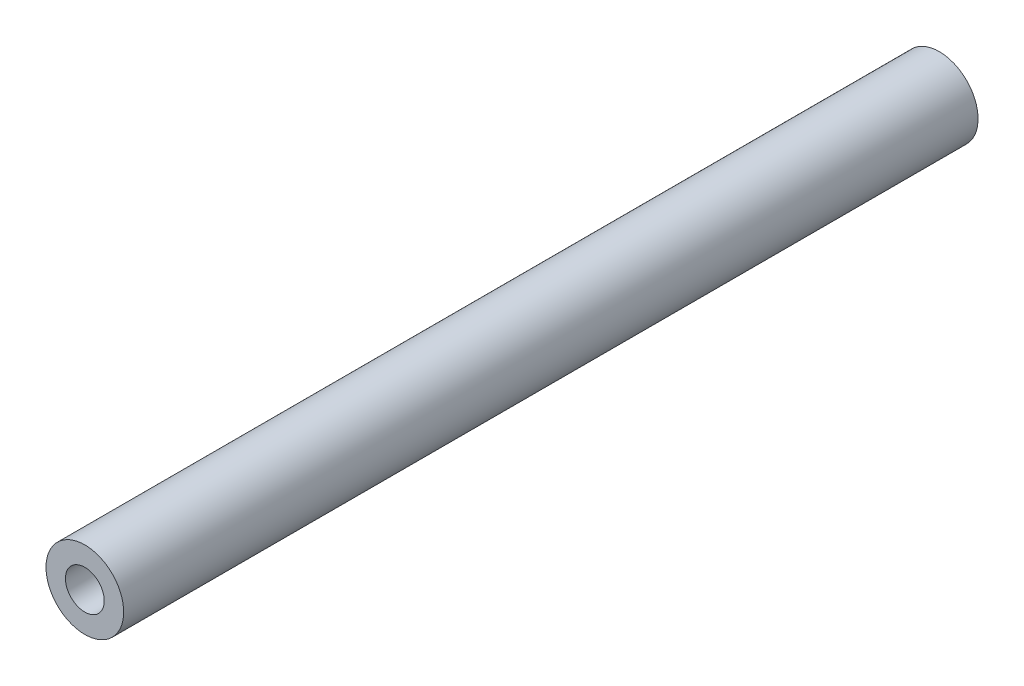
ISO-10303-21;
HEADER;
FILE_DESCRIPTION(('STEP AP214'),'2;1');
FILE_NAME('part.step','',(''),(''),'','','');
FILE_SCHEMA(('AUTOMOTIVE_DESIGN { 1 0 10303 214 1 1 1 1 }'));
ENDSEC;
DATA;
#1=APPLICATION_CONTEXT('core data for automotive mechanical design processes');
#2=APPLICATION_PROTOCOL_DEFINITION('international standard','automotive_design',2000,#1);
#3=PRODUCT_CONTEXT('',#1,'mechanical');
#4=PRODUCT('Part','Part','',(#3));
#5=PRODUCT_RELATED_PRODUCT_CATEGORY('part','',(#4));
#6=PRODUCT_DEFINITION_FORMATION('','',#4);
#7=PRODUCT_DEFINITION_CONTEXT('part definition',#1,'design');
#8=PRODUCT_DEFINITION('design','',#6,#7);
#9=PRODUCT_DEFINITION_SHAPE('','',#8);
#10=(LENGTH_UNIT() NAMED_UNIT(*) SI_UNIT(.MILLI.,.METRE.));
#11=(NAMED_UNIT(*) PLANE_ANGLE_UNIT() SI_UNIT($,.RADIAN.));
#12=(NAMED_UNIT(*) SI_UNIT($,.STERADIAN.) SOLID_ANGLE_UNIT());
#13=UNCERTAINTY_MEASURE_WITH_UNIT(LENGTH_MEASURE(1.E-05),#10,'distance_accuracy_value','');
#14=(GEOMETRIC_REPRESENTATION_CONTEXT(3) GLOBAL_UNCERTAINTY_ASSIGNED_CONTEXT((#13)) GLOBAL_UNIT_ASSIGNED_CONTEXT((#10,
#11,#12)) REPRESENTATION_CONTEXT('',''));
#15=CARTESIAN_POINT('',(0.,0.,0.));
#16=DIRECTION('',(0.,0.,1.));
#17=DIRECTION('',(1.,0.,0.));
#18=AXIS2_PLACEMENT_3D('',#15,#16,#17);
#19=CARTESIAN_POINT('',(-9.90100305181234,-4.34999999998961,-55.5269617901256));
#20=DIRECTION('',(0.,0.,1.));
#21=DIRECTION('',(1.,0.,0.));
#22=AXIS2_PLACEMENT_3D('',#19,#20,#21);
#23=PLANE('',#22);
#24=CARTESIAN_POINT('',(-9.9010030518127,-4.34999999998947,-55.5269617901256));
#25=DIRECTION('',(0.,0.,1.));
#26=DIRECTION('',(1.,0.,0.));
#27=AXIS2_PLACEMENT_3D('',#24,#25,#26);
#28=CIRCLE('',#27,1.);
#29=CARTESIAN_POINT('',(-10.9010030518127,-4.34999999998947,-55.5269617901256));
#30=VERTEX_POINT('',#29);
#31=EDGE_CURVE('E56',#30,#30,#28,.T.);
#32=ORIENTED_EDGE('',*,*,#31,.T.);
#33=EDGE_LOOP('',(#32));
#34=FACE_BOUND('',#33,.T.);
#35=CARTESIAN_POINT('',(-9.90100305181234,-4.34999999998961,-55.5269617901256));
#36=DIRECTION('',(0.,0.,1.));
#37=DIRECTION('',(1.,0.,0.));
#38=AXIS2_PLACEMENT_3D('',#35,#36,#37);
#39=CIRCLE('',#38,2.);
#40=CARTESIAN_POINT('',(-11.9010030518123,-4.34999999998961,-55.5269617901256));
#41=VERTEX_POINT('',#40);
#42=EDGE_CURVE('E11',#41,#41,#39,.T.);
#43=ORIENTED_EDGE('',*,*,#42,.F.);
#44=EDGE_LOOP('',(#43));
#45=FACE_BOUND('',#44,.T.);
#46=ADVANCED_FACE('F16',(#34,#45),#23,.F.);
#47=CARTESIAN_POINT('',(-9.90100305181234,-4.34999999998961,-11.5269617901256));
#48=DIRECTION('',(0.,0.,1.));
#49=DIRECTION('',(1.,0.,0.));
#50=AXIS2_PLACEMENT_3D('',#47,#48,#49);
#51=PLANE('',#50);
#52=CARTESIAN_POINT('',(-9.9010030518127,-4.34999999998947,-11.5269617901256));
#53=DIRECTION('',(0.,0.,-1.));
#54=DIRECTION('',(1.,0.,0.));
#55=AXIS2_PLACEMENT_3D('',#52,#53,#54);
#56=CIRCLE('',#55,1.);
#57=CARTESIAN_POINT('',(-10.9010030518127,-4.34999999998947,-11.5269617901256));
#58=VERTEX_POINT('',#57);
#59=EDGE_CURVE('E55',#58,#58,#56,.T.);
#60=ORIENTED_EDGE('',*,*,#59,.T.);
#61=EDGE_LOOP('',(#60));
#62=FACE_BOUND('',#61,.T.);
#63=CARTESIAN_POINT('',(-9.90100305181234,-4.34999999998961,-11.5269617901256));
#64=DIRECTION('',(0.,0.,1.));
#65=DIRECTION('',(1.,0.,0.));
#66=AXIS2_PLACEMENT_3D('',#63,#64,#65);
#67=CIRCLE('',#66,2.);
#68=CARTESIAN_POINT('',(-11.9010030518123,-4.34999999998961,-11.5269617901256));
#69=VERTEX_POINT('',#68);
#70=EDGE_CURVE('E68',#69,#69,#67,.T.);
#71=ORIENTED_EDGE('',*,*,#70,.T.);
#72=EDGE_LOOP('',(#71));
#73=FACE_BOUND('',#72,.T.);
#74=ADVANCED_FACE('F60',(#62,#73),#51,.T.);
#75=CARTESIAN_POINT('',(-9.90100305181234,-4.34999999998961,-46.5269617901256));
#76=DIRECTION('',(0.,0.,1.));
#77=DIRECTION('',(1.,0.,0.));
#78=AXIS2_PLACEMENT_3D('',#75,#76,#77);
#79=CYLINDRICAL_SURFACE('',#78,2.);
#80=ORIENTED_EDGE('',*,*,#70,.F.);
#81=DIRECTION('',(0.,0.,-1.));
#82=VECTOR('',#81,1.);
#83=CARTESIAN_POINT('',(-11.9010030518123,-4.34999999998961,-46.5269617901256));
#84=LINE('',#83,#82);
#85=EDGE_CURVE('E24',#69,#41,#84,.T.);
#86=ORIENTED_EDGE('',*,*,#85,.T.);
#87=ORIENTED_EDGE('',*,*,#42,.T.);
#88=ORIENTED_EDGE('',*,*,#85,.F.);
#89=EDGE_LOOP('',(#80,#86,#87,#88));
#90=FACE_BOUND('',#89,.T.);
#91=ADVANCED_FACE('F72',(#90),#79,.T.);
#92=CARTESIAN_POINT('',(-9.9010030518127,-4.34999999998947,-46.5269617901256));
#93=DIRECTION('',(0.,0.,1.));
#94=DIRECTION('',(1.,0.,0.));
#95=AXIS2_PLACEMENT_3D('',#92,#93,#94);
#96=CYLINDRICAL_SURFACE('',#95,1.);
#97=ORIENTED_EDGE('',*,*,#59,.F.);
#98=DIRECTION('',(0.,0.,-1.));
#99=VECTOR('',#98,1.);
#100=CARTESIAN_POINT('',(-10.9010030518127,-4.34999999998947,-46.5269617901256));
#101=LINE('',#100,#99);
#102=EDGE_CURVE('E52',#58,#30,#101,.T.);
#103=ORIENTED_EDGE('',*,*,#102,.T.);
#104=ORIENTED_EDGE('',*,*,#31,.F.);
#105=ORIENTED_EDGE('',*,*,#102,.F.);
#106=EDGE_LOOP('',(#97,#103,#104,#105));
#107=FACE_BOUND('',#106,.T.);
#108=ADVANCED_FACE('F54',(#107),#96,.F.);
#109=CLOSED_SHELL('',(#46,#74,#91,#108));
#110=MANIFOLD_SOLID_BREP('B1',#109);
#111=ADVANCED_BREP_SHAPE_REPRESENTATION('',(#18,#110),#14);
#112=SHAPE_DEFINITION_REPRESENTATION(#9,#111);
ENDSEC;
END-ISO-10303-21;
